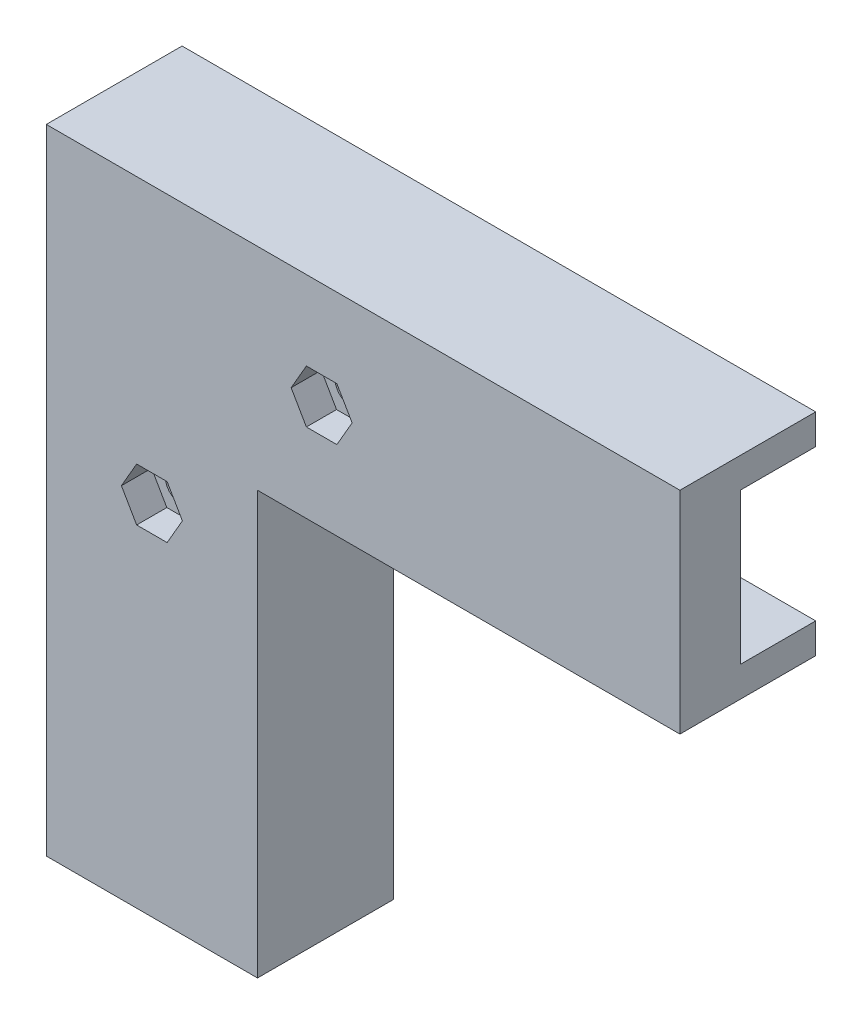
ISO-10303-21;
HEADER;
FILE_DESCRIPTION(('STEP AP214'),'2;1');
FILE_NAME('part.step','',(''),(''),'','','');
FILE_SCHEMA(('AUTOMOTIVE_DESIGN { 1 0 10303 214 1 1 1 1 }'));
ENDSEC;
DATA;
#1=APPLICATION_CONTEXT('core data for automotive mechanical design processes');
#2=APPLICATION_PROTOCOL_DEFINITION('international standard','automotive_design',2000,#1);
#3=PRODUCT_CONTEXT('',#1,'mechanical');
#4=PRODUCT('Part','Part','',(#3));
#5=PRODUCT_RELATED_PRODUCT_CATEGORY('part','',(#4));
#6=PRODUCT_DEFINITION_FORMATION('','',#4);
#7=PRODUCT_DEFINITION_CONTEXT('part definition',#1,'design');
#8=PRODUCT_DEFINITION('design','',#6,#7);
#9=PRODUCT_DEFINITION_SHAPE('','',#8);
#10=(LENGTH_UNIT() NAMED_UNIT(*) SI_UNIT(.MILLI.,.METRE.));
#11=(NAMED_UNIT(*) PLANE_ANGLE_UNIT() SI_UNIT($,.RADIAN.));
#12=(NAMED_UNIT(*) SI_UNIT($,.STERADIAN.) SOLID_ANGLE_UNIT());
#13=UNCERTAINTY_MEASURE_WITH_UNIT(LENGTH_MEASURE(1.E-05),#10,'distance_accuracy_value','');
#14=(GEOMETRIC_REPRESENTATION_CONTEXT(3) GLOBAL_UNCERTAINTY_ASSIGNED_CONTEXT((#13)) GLOBAL_UNIT_ASSIGNED_CONTEXT((#10,
#11,#12)) REPRESENTATION_CONTEXT('',''));
#15=CARTESIAN_POINT('',(0.,0.,0.));
#16=DIRECTION('',(0.,0.,1.));
#17=DIRECTION('',(1.,0.,0.));
#18=AXIS2_PLACEMENT_3D('',#15,#16,#17);
#19=CARTESIAN_POINT('',(0.,0.,8.));
#20=DIRECTION('',(0.,0.,1.));
#21=DIRECTION('',(1.,0.,0.));
#22=AXIS2_PLACEMENT_3D('',#19,#20,#21);
#23=PLANE('',#22);
#24=DIRECTION('',(1.,0.,0.));
#25=VECTOR('',#24,1.);
#26=CARTESIAN_POINT('',(-20.,0.,8.));
#27=LINE('',#26,#25);
#28=CARTESIAN_POINT('',(-24.,0.,8.));
#29=VERTEX_POINT('',#28);
#30=CARTESIAN_POINT('',(4.,0.,8.));
#31=VERTEX_POINT('',#30);
#32=EDGE_CURVE('E392',#29,#31,#27,.T.);
#33=ORIENTED_EDGE('',*,*,#32,.T.);
#34=DIRECTION('',(0.,1.,0.));
#35=VECTOR('',#34,1.);
#36=CARTESIAN_POINT('',(3.99999999999999,56.,8.));
#37=LINE('',#36,#35);
#38=CARTESIAN_POINT('',(3.99999999999999,56.,8.));
#39=VERTEX_POINT('',#38);
#40=EDGE_CURVE('E244',#31,#39,#37,.T.);
#41=ORIENTED_EDGE('',*,*,#40,.T.);
#42=DIRECTION('',(1.,0.,0.));
#43=VECTOR('',#42,1.);
#44=CARTESIAN_POINT('',(60.,56.,8.));
#45=LINE('',#44,#43);
#46=CARTESIAN_POINT('',(60.,56.,8.));
#47=VERTEX_POINT('',#46);
#48=EDGE_CURVE('E258',#39,#47,#45,.T.);
#49=ORIENTED_EDGE('',*,*,#48,.T.);
#50=DIRECTION('',(0.,1.,0.));
#51=VECTOR('',#50,1.);
#52=CARTESIAN_POINT('',(60.,60.,8.));
#53=LINE('',#52,#51);
#54=CARTESIAN_POINT('',(60.,84.,8.));
#55=VERTEX_POINT('',#54);
#56=EDGE_CURVE('E394',#47,#55,#53,.T.);
#57=ORIENTED_EDGE('',*,*,#56,.T.);
#58=DIRECTION('',(-1.,0.,0.));
#59=VECTOR('',#58,1.);
#60=CARTESIAN_POINT('',(60.,84.,8.));
#61=LINE('',#60,#59);
#62=CARTESIAN_POINT('',(-24.,84.,8.));
#63=VERTEX_POINT('',#62);
#64=EDGE_CURVE('E230',#55,#63,#61,.T.);
#65=ORIENTED_EDGE('',*,*,#64,.T.);
#66=DIRECTION('',(0.,-1.,0.));
#67=VECTOR('',#66,1.);
#68=CARTESIAN_POINT('',(-24.,84.,8.));
#69=LINE('',#68,#67);
#70=EDGE_CURVE('E227',#63,#29,#69,.T.);
#71=ORIENTED_EDGE('',*,*,#70,.T.);
#72=EDGE_LOOP('',(#33,#41,#49,#57,#65,#71));
#73=FACE_BOUND('',#72,.T.);
#74=DIRECTION('',(-1.,0.,0.));
#75=VECTOR('',#74,1.);
#76=CARTESIAN_POINT('',(0.,66.5,8.));
#77=LINE('',#76,#75);
#78=CARTESIAN_POINT('',(14.5207259421637,66.5,8.));
#79=VERTEX_POINT('',#78);
#80=CARTESIAN_POINT('',(10.4792740578363,66.5,8.));
#81=VERTEX_POINT('',#80);
#82=EDGE_CURVE('E364',#79,#81,#77,.T.);
#83=ORIENTED_EDGE('',*,*,#82,.T.);
#84=DIRECTION('',(-0.5,0.866025403784439,0.));
#85=VECTOR('',#84,1.);
#86=CARTESIAN_POINT('',(36.6548002192098,21.1626587736527,8.));
#87=LINE('',#86,#85);
#88=CARTESIAN_POINT('',(8.45854811567259,70.,8.));
#89=VERTEX_POINT('',#88);
#90=EDGE_CURVE('E336',#81,#89,#87,.T.);
#91=ORIENTED_EDGE('',*,*,#90,.T.);
#92=DIRECTION('',(0.499999999999996,0.866025403784441,0.));
#93=VECTOR('',#92,1.);
#94=CARTESIAN_POINT('',(-23.9669780457007,13.837341226347,8.));
#95=LINE('',#94,#93);
#96=CARTESIAN_POINT('',(10.4792740578363,73.5,8.));
#97=VERTEX_POINT('',#96);
#98=EDGE_CURVE('E351',#89,#97,#95,.T.);
#99=ORIENTED_EDGE('',*,*,#98,.T.);
#100=DIRECTION('',(1.,0.,0.));
#101=VECTOR('',#100,1.);
#102=CARTESIAN_POINT('',(0.,73.5,8.));
#103=LINE('',#102,#101);
#104=CARTESIAN_POINT('',(14.5207259421637,73.5,8.));
#105=VERTEX_POINT('',#104);
#106=EDGE_CURVE('E373',#97,#105,#103,.T.);
#107=ORIENTED_EDGE('',*,*,#106,.T.);
#108=DIRECTION('',(0.5,-0.866025403784439,0.));
#109=VECTOR('',#108,1.);
#110=CARTESIAN_POINT('',(42.7169780457009,24.6626587736527,8.));
#111=LINE('',#110,#109);
#112=CARTESIAN_POINT('',(16.5414518843274,70.,8.));
#113=VERTEX_POINT('',#112);
#114=EDGE_CURVE('E370',#105,#113,#111,.T.);
#115=ORIENTED_EDGE('',*,*,#114,.T.);
#116=DIRECTION('',(-0.500000000000001,-0.866025403784438,0.));
#117=VECTOR('',#116,1.);
#118=CARTESIAN_POINT('',(-17.9048002192099,10.3373412263473,8.));
#119=LINE('',#118,#117);
#120=EDGE_CURVE('E367',#113,#79,#119,.T.);
#121=ORIENTED_EDGE('',*,*,#120,.T.);
#122=EDGE_LOOP('',(#83,#91,#99,#107,#115,#121));
#123=FACE_BOUND('',#122,.T.);
#124=DIRECTION('',(-1.,0.,0.));
#125=VECTOR('',#124,1.);
#126=CARTESIAN_POINT('',(0.,44.,8.));
#127=LINE('',#126,#125);
#128=CARTESIAN_POINT('',(-7.97927405783629,44.,8.));
#129=VERTEX_POINT('',#128);
#130=CARTESIAN_POINT('',(-12.0207259421637,44.,8.));
#131=VERTEX_POINT('',#130);
#132=EDGE_CURVE('E319',#129,#131,#127,.T.);
#133=ORIENTED_EDGE('',*,*,#132,.T.);
#134=DIRECTION('',(-0.5,0.866025403784439,0.));
#135=VECTOR('',#134,1.);
#136=CARTESIAN_POINT('',(10.0370144266349,5.79487298107779,8.));
#137=LINE('',#136,#135);
#138=CARTESIAN_POINT('',(-14.0414518843274,47.5,8.));
#139=VERTEX_POINT('',#138);
#140=EDGE_CURVE('E299',#131,#139,#137,.T.);
#141=ORIENTED_EDGE('',*,*,#140,.T.);
#142=DIRECTION('',(0.5,0.866025403784438,0.));
#143=VECTOR('',#142,1.);
#144=CARTESIAN_POINT('',(-31.099192253126,17.9551270189222,8.));
#145=LINE('',#144,#143);
#146=CARTESIAN_POINT('',(-12.0207259421637,51.,8.));
#147=VERTEX_POINT('',#146);
#148=EDGE_CURVE('E306',#139,#147,#145,.T.);
#149=ORIENTED_EDGE('',*,*,#148,.T.);
#150=DIRECTION('',(1.,0.,0.));
#151=VECTOR('',#150,1.);
#152=CARTESIAN_POINT('',(-1.75126958938504E-13,51.,8.));
#153=LINE('',#152,#151);
#154=CARTESIAN_POINT('',(-7.97927405783632,51.,8.));
#155=VERTEX_POINT('',#154);
#156=EDGE_CURVE('E328',#147,#155,#153,.T.);
#157=ORIENTED_EDGE('',*,*,#156,.T.);
#158=DIRECTION('',(0.5,-0.866025403784439,0.));
#159=VECTOR('',#158,1.);
#160=CARTESIAN_POINT('',(16.0991922531259,9.29487298107778,8.));
#161=LINE('',#160,#159);
#162=CARTESIAN_POINT('',(-5.95854811567261,47.5,8.));
#163=VERTEX_POINT('',#162);
#164=EDGE_CURVE('E325',#155,#163,#161,.T.);
#165=ORIENTED_EDGE('',*,*,#164,.T.);
#166=DIRECTION('',(-0.499999999999999,-0.866025403784439,0.));
#167=VECTOR('',#166,1.);
#168=CARTESIAN_POINT('',(-25.0370144266349,14.4551270189221,8.));
#169=LINE('',#168,#167);
#170=EDGE_CURVE('E322',#163,#129,#169,.T.);
#171=ORIENTED_EDGE('',*,*,#170,.T.);
#172=EDGE_LOOP('',(#133,#141,#149,#157,#165,#171));
#173=FACE_BOUND('',#172,.T.);
#174=ADVANCED_FACE('F33',(#73,#123,#173),#23,.T.);
#175=CARTESIAN_POINT('',(-20.,0.,8.));
#176=DIRECTION('',(0.,1.,0.));
#177=DIRECTION('',(0.,0.,1.));
#178=AXIS2_PLACEMENT_3D('',#175,#176,#177);
#179=PLANE('',#178);
#180=DIRECTION('',(1.,0.,0.));
#181=VECTOR('',#180,1.);
#182=CARTESIAN_POINT('',(-20.,0.,0.));
#183=LINE('',#182,#181);
#184=CARTESIAN_POINT('',(-20.,0.,0.));
#185=VERTEX_POINT('',#184);
#186=CARTESIAN_POINT('',(0.,0.,0.));
#187=VERTEX_POINT('',#186);
#188=EDGE_CURVE('E381',#185,#187,#183,.T.);
#189=ORIENTED_EDGE('',*,*,#188,.T.);
#190=DIRECTION('',(0.,0.,1.));
#191=VECTOR('',#190,1.);
#192=CARTESIAN_POINT('',(0.,0.,-10.));
#193=LINE('',#192,#191);
#194=CARTESIAN_POINT('',(0.,0.,-10.));
#195=VERTEX_POINT('',#194);
#196=EDGE_CURVE('E277',#195,#187,#193,.T.);
#197=ORIENTED_EDGE('',*,*,#196,.F.);
#198=DIRECTION('',(1.,0.,0.));
#199=VECTOR('',#198,1.);
#200=CARTESIAN_POINT('',(4.,0.,-10.));
#201=LINE('',#200,#199);
#202=CARTESIAN_POINT('',(4.,0.,-10.));
#203=VERTEX_POINT('',#202);
#204=EDGE_CURVE('E254',#195,#203,#201,.T.);
#205=ORIENTED_EDGE('',*,*,#204,.T.);
#206=DIRECTION('',(0.,0.,1.));
#207=VECTOR('',#206,1.);
#208=CARTESIAN_POINT('',(4.,0.,-10.));
#209=LINE('',#208,#207);
#210=EDGE_CURVE('E272',#203,#31,#209,.T.);
#211=ORIENTED_EDGE('',*,*,#210,.T.);
#212=ORIENTED_EDGE('',*,*,#32,.F.);
#213=DIRECTION('',(0.,0.,1.));
#214=VECTOR('',#213,1.);
#215=CARTESIAN_POINT('',(-24.,0.,-10.));
#216=LINE('',#215,#214);
#217=CARTESIAN_POINT('',(-24.,0.,-10.));
#218=VERTEX_POINT('',#217);
#219=EDGE_CURVE('E248',#218,#29,#216,.T.);
#220=ORIENTED_EDGE('',*,*,#219,.F.);
#221=DIRECTION('',(1.,0.,0.));
#222=VECTOR('',#221,1.);
#223=CARTESIAN_POINT('',(-24.,0.,-10.));
#224=LINE('',#223,#222);
#225=CARTESIAN_POINT('',(-20.,0.,-10.));
#226=VERTEX_POINT('',#225);
#227=EDGE_CURVE('E237',#218,#226,#224,.T.);
#228=ORIENTED_EDGE('',*,*,#227,.T.);
#229=DIRECTION('',(0.,0.,1.));
#230=VECTOR('',#229,1.);
#231=CARTESIAN_POINT('',(-20.,0.,-10.));
#232=LINE('',#231,#230);
#233=EDGE_CURVE('E245',#226,#185,#232,.T.);
#234=ORIENTED_EDGE('',*,*,#233,.T.);
#235=EDGE_LOOP('',(#189,#197,#205,#211,#212,#220,#228,#234));
#236=FACE_BOUND('',#235,.T.);
#237=ADVANCED_FACE('F428',(#236),#179,.F.);
#238=CARTESIAN_POINT('',(60.,60.,8.));
#239=DIRECTION('',(-1.,0.,0.));
#240=DIRECTION('',(0.,0.,1.));
#241=AXIS2_PLACEMENT_3D('',#238,#239,#240);
#242=PLANE('',#241);
#243=DIRECTION('',(0.,1.,0.));
#244=VECTOR('',#243,1.);
#245=CARTESIAN_POINT('',(60.,60.,0.));
#246=LINE('',#245,#244);
#247=CARTESIAN_POINT('',(60.,60.,0.));
#248=VERTEX_POINT('',#247);
#249=CARTESIAN_POINT('',(60.,80.,0.));
#250=VERTEX_POINT('',#249);
#251=EDGE_CURVE('E205',#248,#250,#246,.T.);
#252=ORIENTED_EDGE('',*,*,#251,.T.);
#253=DIRECTION('',(0.,0.,1.));
#254=VECTOR('',#253,1.);
#255=CARTESIAN_POINT('',(60.,80.,-10.));
#256=LINE('',#255,#254);
#257=CARTESIAN_POINT('',(60.,80.,-10.));
#258=VERTEX_POINT('',#257);
#259=EDGE_CURVE('E198',#258,#250,#256,.T.);
#260=ORIENTED_EDGE('',*,*,#259,.F.);
#261=DIRECTION('',(0.,1.,0.));
#262=VECTOR('',#261,1.);
#263=CARTESIAN_POINT('',(60.,80.,-10.));
#264=LINE('',#263,#262);
#265=CARTESIAN_POINT('',(60.,84.,-10.));
#266=VERTEX_POINT('',#265);
#267=EDGE_CURVE('E202',#258,#266,#264,.T.);
#268=ORIENTED_EDGE('',*,*,#267,.T.);
#269=DIRECTION('',(0.,0.,1.));
#270=VECTOR('',#269,1.);
#271=CARTESIAN_POINT('',(60.,84.,-10.));
#272=LINE('',#271,#270);
#273=EDGE_CURVE('E210',#266,#55,#272,.T.);
#274=ORIENTED_EDGE('',*,*,#273,.T.);
#275=ORIENTED_EDGE('',*,*,#56,.F.);
#276=DIRECTION('',(0.,0.,1.));
#277=VECTOR('',#276,1.);
#278=CARTESIAN_POINT('',(60.,56.,-10.));
#279=LINE('',#278,#277);
#280=CARTESIAN_POINT('',(60.,56.,-10.));
#281=VERTEX_POINT('',#280);
#282=EDGE_CURVE('E283',#281,#47,#279,.T.);
#283=ORIENTED_EDGE('',*,*,#282,.F.);
#284=DIRECTION('',(0.,1.,0.));
#285=VECTOR('',#284,1.);
#286=CARTESIAN_POINT('',(60.,60.,-10.));
#287=LINE('',#286,#285);
#288=CARTESIAN_POINT('',(60.,60.,-10.));
#289=VERTEX_POINT('',#288);
#290=EDGE_CURVE('E264',#281,#289,#287,.T.);
#291=ORIENTED_EDGE('',*,*,#290,.T.);
#292=DIRECTION('',(0.,0.,1.));
#293=VECTOR('',#292,1.);
#294=CARTESIAN_POINT('',(60.,60.,-10.));
#295=LINE('',#294,#293);
#296=EDGE_CURVE('E281',#289,#248,#295,.T.);
#297=ORIENTED_EDGE('',*,*,#296,.T.);
#298=EDGE_LOOP('',(#252,#260,#268,#274,#275,#283,#291,#297));
#299=FACE_BOUND('',#298,.T.);
#300=ADVANCED_FACE('F200',(#299),#242,.F.);
#301=CARTESIAN_POINT('',(0.,0.,0.));
#302=DIRECTION('',(0.,0.,1.));
#303=DIRECTION('',(1.,0.,0.));
#304=AXIS2_PLACEMENT_3D('',#301,#302,#303);
#305=PLANE('',#304);
#306=CARTESIAN_POINT('',(12.5,70.,0.));
#307=DIRECTION('',(0.,0.,1.));
#308=DIRECTION('',(1.,0.,0.));
#309=AXIS2_PLACEMENT_3D('',#306,#307,#308);
#310=CIRCLE('',#309,2.25);
#311=CARTESIAN_POINT('',(14.75,70.,0.));
#312=VERTEX_POINT('',#311);
#313=EDGE_CURVE('E290',#312,#312,#310,.T.);
#314=ORIENTED_EDGE('',*,*,#313,.T.);
#315=EDGE_LOOP('',(#314));
#316=FACE_BOUND('',#315,.T.);
#317=CARTESIAN_POINT('',(-10.,47.5,0.));
#318=DIRECTION('',(0.,0.,1.));
#319=DIRECTION('',(1.,0.,0.));
#320=AXIS2_PLACEMENT_3D('',#317,#318,#319);
#321=CIRCLE('',#320,2.25);
#322=CARTESIAN_POINT('',(-7.75,47.5,0.));
#323=VERTEX_POINT('',#322);
#324=EDGE_CURVE('E296',#323,#323,#321,.T.);
#325=ORIENTED_EDGE('',*,*,#324,.T.);
#326=EDGE_LOOP('',(#325));
#327=FACE_BOUND('',#326,.T.);
#328=ORIENTED_EDGE('',*,*,#188,.F.);
#329=DIRECTION('',(0.,-1.,0.));
#330=VECTOR('',#329,1.);
#331=CARTESIAN_POINT('',(-20.,80.,0.));
#332=LINE('',#331,#330);
#333=CARTESIAN_POINT('',(-20.,80.,0.));
#334=VERTEX_POINT('',#333);
#335=EDGE_CURVE('E395',#334,#185,#332,.T.);
#336=ORIENTED_EDGE('',*,*,#335,.F.);
#337=DIRECTION('',(-1.,0.,0.));
#338=VECTOR('',#337,1.);
#339=CARTESIAN_POINT('',(60.,80.,0.));
#340=LINE('',#339,#338);
#341=EDGE_CURVE('E405',#250,#334,#340,.T.);
#342=ORIENTED_EDGE('',*,*,#341,.F.);
#343=ORIENTED_EDGE('',*,*,#251,.F.);
#344=DIRECTION('',(1.,0.,0.));
#345=VECTOR('',#344,1.);
#346=CARTESIAN_POINT('',(0.,60.,0.));
#347=LINE('',#346,#345);
#348=CARTESIAN_POINT('',(6.,60.,0.));
#349=VERTEX_POINT('',#348);
#350=EDGE_CURVE('E402',#349,#248,#347,.T.);
#351=ORIENTED_EDGE('',*,*,#350,.F.);
#352=CARTESIAN_POINT('',(6.,54.,0.));
#353=DIRECTION('',(0.,0.,1.));
#354=DIRECTION('',(1.,0.,0.));
#355=AXIS2_PLACEMENT_3D('',#352,#353,#354);
#356=CIRCLE('',#355,6.);
#357=CARTESIAN_POINT('',(0.,54.,0.));
#358=VERTEX_POINT('',#357);
#359=EDGE_CURVE('E11',#349,#358,#356,.T.);
#360=ORIENTED_EDGE('',*,*,#359,.T.);
#361=DIRECTION('',(0.,1.,0.));
#362=VECTOR('',#361,1.);
#363=CARTESIAN_POINT('',(0.,0.,0.));
#364=LINE('',#363,#362);
#365=EDGE_CURVE('E400',#187,#358,#364,.T.);
#366=ORIENTED_EDGE('',*,*,#365,.F.);
#367=EDGE_LOOP('',(#328,#336,#342,#343,#351,#360,#366));
#368=FACE_BOUND('',#367,.T.);
#369=ADVANCED_FACE('F440',(#316,#327,#368),#305,.F.);
#370=CARTESIAN_POINT('',(36.6548002192098,21.1626587736527,4.));
#371=DIRECTION('',(0.866025403784439,0.5,0.));
#372=DIRECTION('',(-0.5,0.866025403784439,0.));
#373=AXIS2_PLACEMENT_3D('',#370,#371,#372);
#374=PLANE('',#373);
#375=ORIENTED_EDGE('',*,*,#90,.F.);
#376=DIRECTION('',(0.,0.,1.));
#377=VECTOR('',#376,1.);
#378=CARTESIAN_POINT('',(10.4792740578363,66.5,4.));
#379=LINE('',#378,#377);
#380=CARTESIAN_POINT('',(10.4792740578363,66.5,4.));
#381=VERTEX_POINT('',#380);
#382=EDGE_CURVE('E361',#381,#81,#379,.T.);
#383=ORIENTED_EDGE('',*,*,#382,.F.);
#384=DIRECTION('',(-0.5,0.866025403784439,0.));
#385=VECTOR('',#384,1.);
#386=CARTESIAN_POINT('',(36.6548002192098,21.1626587736527,4.));
#387=LINE('',#386,#385);
#388=CARTESIAN_POINT('',(8.45854811567259,70.,4.));
#389=VERTEX_POINT('',#388);
#390=EDGE_CURVE('E347',#381,#389,#387,.T.);
#391=ORIENTED_EDGE('',*,*,#390,.T.);
#392=DIRECTION('',(0.,0.,1.));
#393=VECTOR('',#392,1.);
#394=CARTESIAN_POINT('',(8.45854811567259,70.,4.));
#395=LINE('',#394,#393);
#396=EDGE_CURVE('E378',#389,#89,#395,.T.);
#397=ORIENTED_EDGE('',*,*,#396,.T.);
#398=EDGE_LOOP('',(#375,#383,#391,#397));
#399=FACE_BOUND('',#398,.T.);
#400=ADVANCED_FACE('F438',(#399),#374,.T.);
#401=CARTESIAN_POINT('',(-23.9669780457007,13.837341226347,4.));
#402=DIRECTION('',(0.866025403784441,-0.499999999999996,0.));
#403=DIRECTION('',(0.499999999999996,0.866025403784441,0.));
#404=AXIS2_PLACEMENT_3D('',#401,#402,#403);
#405=PLANE('',#404);
#406=ORIENTED_EDGE('',*,*,#98,.F.);
#407=ORIENTED_EDGE('',*,*,#396,.F.);
#408=DIRECTION('',(0.499999999999996,0.866025403784441,0.));
#409=VECTOR('',#408,1.);
#410=CARTESIAN_POINT('',(-23.9669780457007,13.837341226347,4.));
#411=LINE('',#410,#409);
#412=CARTESIAN_POINT('',(10.4792740578363,73.5,4.));
#413=VERTEX_POINT('',#412);
#414=EDGE_CURVE('E359',#389,#413,#411,.T.);
#415=ORIENTED_EDGE('',*,*,#414,.T.);
#416=DIRECTION('',(0.,0.,1.));
#417=VECTOR('',#416,1.);
#418=CARTESIAN_POINT('',(10.4792740578363,73.5,4.));
#419=LINE('',#418,#417);
#420=EDGE_CURVE('E382',#413,#97,#419,.T.);
#421=ORIENTED_EDGE('',*,*,#420,.T.);
#422=EDGE_LOOP('',(#406,#407,#415,#421));
#423=FACE_BOUND('',#422,.T.);
#424=ADVANCED_FACE('F462',(#423),#405,.T.);
#425=CARTESIAN_POINT('',(0.,73.5,4.));
#426=DIRECTION('',(0.,-1.,0.));
#427=DIRECTION('',(0.,0.,-1.));
#428=AXIS2_PLACEMENT_3D('',#425,#426,#427);
#429=PLANE('',#428);
#430=ORIENTED_EDGE('',*,*,#106,.F.);
#431=ORIENTED_EDGE('',*,*,#420,.F.);
#432=DIRECTION('',(1.,0.,0.));
#433=VECTOR('',#432,1.);
#434=CARTESIAN_POINT('',(0.,73.5,4.));
#435=LINE('',#434,#433);
#436=CARTESIAN_POINT('',(14.5207259421637,73.5,4.));
#437=VERTEX_POINT('',#436);
#438=EDGE_CURVE('E357',#413,#437,#435,.T.);
#439=ORIENTED_EDGE('',*,*,#438,.T.);
#440=DIRECTION('',(0.,0.,1.));
#441=VECTOR('',#440,1.);
#442=CARTESIAN_POINT('',(14.5207259421637,73.5,4.));
#443=LINE('',#442,#441);
#444=EDGE_CURVE('E384',#437,#105,#443,.T.);
#445=ORIENTED_EDGE('',*,*,#444,.T.);
#446=EDGE_LOOP('',(#430,#431,#439,#445));
#447=FACE_BOUND('',#446,.T.);
#448=ADVANCED_FACE('F469',(#447),#429,.T.);
#449=CARTESIAN_POINT('',(42.7169780457009,24.6626587736527,4.));
#450=DIRECTION('',(-0.866025403784439,-0.5,0.));
#451=DIRECTION('',(0.5,-0.866025403784439,0.));
#452=AXIS2_PLACEMENT_3D('',#449,#450,#451);
#453=PLANE('',#452);
#454=ORIENTED_EDGE('',*,*,#114,.F.);
#455=ORIENTED_EDGE('',*,*,#444,.F.);
#456=DIRECTION('',(0.5,-0.866025403784439,0.));
#457=VECTOR('',#456,1.);
#458=CARTESIAN_POINT('',(42.7169780457009,24.6626587736527,4.));
#459=LINE('',#458,#457);
#460=CARTESIAN_POINT('',(16.5414518843274,70.,4.));
#461=VERTEX_POINT('',#460);
#462=EDGE_CURVE('E355',#437,#461,#459,.T.);
#463=ORIENTED_EDGE('',*,*,#462,.T.);
#464=DIRECTION('',(0.,0.,1.));
#465=VECTOR('',#464,1.);
#466=CARTESIAN_POINT('',(16.5414518843274,70.,4.));
#467=LINE('',#466,#465);
#468=EDGE_CURVE('E386',#461,#113,#467,.T.);
#469=ORIENTED_EDGE('',*,*,#468,.T.);
#470=EDGE_LOOP('',(#454,#455,#463,#469));
#471=FACE_BOUND('',#470,.T.);
#472=ADVANCED_FACE('F477',(#471),#453,.T.);
#473=CARTESIAN_POINT('',(-17.9048002192099,10.3373412263473,4.));
#474=DIRECTION('',(-0.866025403784438,0.500000000000001,0.));
#475=DIRECTION('',(-0.500000000000001,-0.866025403784438,0.));
#476=AXIS2_PLACEMENT_3D('',#473,#474,#475);
#477=PLANE('',#476);
#478=ORIENTED_EDGE('',*,*,#120,.F.);
#479=ORIENTED_EDGE('',*,*,#468,.F.);
#480=DIRECTION('',(-0.500000000000001,-0.866025403784438,0.));
#481=VECTOR('',#480,1.);
#482=CARTESIAN_POINT('',(-17.9048002192099,10.3373412263473,4.));
#483=LINE('',#482,#481);
#484=CARTESIAN_POINT('',(14.5207259421637,66.5,4.));
#485=VERTEX_POINT('',#484);
#486=EDGE_CURVE('E353',#461,#485,#483,.T.);
#487=ORIENTED_EDGE('',*,*,#486,.T.);
#488=DIRECTION('',(0.,0.,1.));
#489=VECTOR('',#488,1.);
#490=CARTESIAN_POINT('',(14.5207259421637,66.5,4.));
#491=LINE('',#490,#489);
#492=EDGE_CURVE('E388',#485,#79,#491,.T.);
#493=ORIENTED_EDGE('',*,*,#492,.T.);
#494=EDGE_LOOP('',(#478,#479,#487,#493));
#495=FACE_BOUND('',#494,.T.);
#496=ADVANCED_FACE('F485',(#495),#477,.T.);
#497=CARTESIAN_POINT('',(0.,66.5,4.));
#498=DIRECTION('',(0.,1.,0.));
#499=DIRECTION('',(0.,0.,1.));
#500=AXIS2_PLACEMENT_3D('',#497,#498,#499);
#501=PLANE('',#500);
#502=ORIENTED_EDGE('',*,*,#82,.F.);
#503=ORIENTED_EDGE('',*,*,#492,.F.);
#504=DIRECTION('',(-1.,0.,0.));
#505=VECTOR('',#504,1.);
#506=CARTESIAN_POINT('',(0.,66.5,4.));
#507=LINE('',#506,#505);
#508=EDGE_CURVE('E350',#485,#381,#507,.T.);
#509=ORIENTED_EDGE('',*,*,#508,.T.);
#510=ORIENTED_EDGE('',*,*,#382,.T.);
#511=EDGE_LOOP('',(#502,#503,#509,#510));
#512=FACE_BOUND('',#511,.T.);
#513=ADVANCED_FACE('F493',(#512),#501,.T.);
#514=CARTESIAN_POINT('',(0.,0.,4.));
#515=DIRECTION('',(0.,0.,1.));
#516=DIRECTION('',(1.,0.,0.));
#517=AXIS2_PLACEMENT_3D('',#514,#515,#516);
#518=PLANE('',#517);
#519=CARTESIAN_POINT('',(12.5,70.,4.));
#520=DIRECTION('',(0.,0.,1.));
#521=DIRECTION('',(1.,0.,0.));
#522=AXIS2_PLACEMENT_3D('',#519,#520,#521);
#523=CIRCLE('',#522,2.25);
#524=CARTESIAN_POINT('',(14.75,70.,4.));
#525=VERTEX_POINT('',#524);
#526=EDGE_CURVE('E280',#525,#525,#523,.T.);
#527=ORIENTED_EDGE('',*,*,#526,.F.);
#528=EDGE_LOOP('',(#527));
#529=FACE_BOUND('',#528,.T.);
#530=ORIENTED_EDGE('',*,*,#390,.F.);
#531=ORIENTED_EDGE('',*,*,#508,.F.);
#532=ORIENTED_EDGE('',*,*,#486,.F.);
#533=ORIENTED_EDGE('',*,*,#462,.F.);
#534=ORIENTED_EDGE('',*,*,#438,.F.);
#535=ORIENTED_EDGE('',*,*,#414,.F.);
#536=EDGE_LOOP('',(#530,#531,#532,#533,#534,#535));
#537=FACE_BOUND('',#536,.T.);
#538=ADVANCED_FACE('F501',(#529,#537),#518,.T.);
#539=CARTESIAN_POINT('',(10.0370144266349,5.79487298107779,4.));
#540=DIRECTION('',(0.866025403784439,0.5,0.));
#541=DIRECTION('',(-0.5,0.866025403784439,0.));
#542=AXIS2_PLACEMENT_3D('',#539,#540,#541);
#543=PLANE('',#542);
#544=ORIENTED_EDGE('',*,*,#140,.F.);
#545=DIRECTION('',(0.,0.,1.));
#546=VECTOR('',#545,1.);
#547=CARTESIAN_POINT('',(-12.0207259421637,44.,4.));
#548=LINE('',#547,#546);
#549=CARTESIAN_POINT('',(-12.0207259421637,44.,4.));
#550=VERTEX_POINT('',#549);
#551=EDGE_CURVE('E316',#550,#131,#548,.T.);
#552=ORIENTED_EDGE('',*,*,#551,.F.);
#553=DIRECTION('',(-0.5,0.866025403784439,0.));
#554=VECTOR('',#553,1.);
#555=CARTESIAN_POINT('',(10.0370144266349,5.79487298107779,4.));
#556=LINE('',#555,#554);
#557=CARTESIAN_POINT('',(-14.0414518843274,47.5,4.));
#558=VERTEX_POINT('',#557);
#559=EDGE_CURVE('E302',#550,#558,#556,.T.);
#560=ORIENTED_EDGE('',*,*,#559,.T.);
#561=DIRECTION('',(0.,0.,1.));
#562=VECTOR('',#561,1.);
#563=CARTESIAN_POINT('',(-14.0414518843274,47.5,4.));
#564=LINE('',#563,#562);
#565=EDGE_CURVE('E333',#558,#139,#564,.T.);
#566=ORIENTED_EDGE('',*,*,#565,.T.);
#567=EDGE_LOOP('',(#544,#552,#560,#566));
#568=FACE_BOUND('',#567,.T.);
#569=ADVANCED_FACE('F509',(#568),#543,.T.);
#570=CARTESIAN_POINT('',(-31.099192253126,17.9551270189222,4.));
#571=DIRECTION('',(0.866025403784438,-0.5,0.));
#572=DIRECTION('',(0.5,0.866025403784438,0.));
#573=AXIS2_PLACEMENT_3D('',#570,#571,#572);
#574=PLANE('',#573);
#575=ORIENTED_EDGE('',*,*,#148,.F.);
#576=ORIENTED_EDGE('',*,*,#565,.F.);
#577=DIRECTION('',(0.5,0.866025403784438,0.));
#578=VECTOR('',#577,1.);
#579=CARTESIAN_POINT('',(-31.099192253126,17.9551270189222,4.));
#580=LINE('',#579,#578);
#581=CARTESIAN_POINT('',(-12.0207259421637,51.,4.));
#582=VERTEX_POINT('',#581);
#583=EDGE_CURVE('E314',#558,#582,#580,.T.);
#584=ORIENTED_EDGE('',*,*,#583,.T.);
#585=DIRECTION('',(0.,0.,1.));
#586=VECTOR('',#585,1.);
#587=CARTESIAN_POINT('',(-12.0207259421637,51.,4.));
#588=LINE('',#587,#586);
#589=EDGE_CURVE('E337',#582,#147,#588,.T.);
#590=ORIENTED_EDGE('',*,*,#589,.T.);
#591=EDGE_LOOP('',(#575,#576,#584,#590));
#592=FACE_BOUND('',#591,.T.);
#593=ADVANCED_FACE('F518',(#592),#574,.T.);
#594=CARTESIAN_POINT('',(-1.75126958938504E-13,51.,4.));
#595=DIRECTION('',(0.,-1.,0.));
#596=DIRECTION('',(1.,0.,0.));
#597=AXIS2_PLACEMENT_3D('',#594,#595,#596);
#598=PLANE('',#597);
#599=ORIENTED_EDGE('',*,*,#156,.F.);
#600=ORIENTED_EDGE('',*,*,#589,.F.);
#601=DIRECTION('',(1.,0.,0.));
#602=VECTOR('',#601,1.);
#603=CARTESIAN_POINT('',(-1.75126958938504E-13,51.,4.));
#604=LINE('',#603,#602);
#605=CARTESIAN_POINT('',(-7.97927405783632,51.,4.));
#606=VERTEX_POINT('',#605);
#607=EDGE_CURVE('E312',#582,#606,#604,.T.);
#608=ORIENTED_EDGE('',*,*,#607,.T.);
#609=DIRECTION('',(0.,0.,1.));
#610=VECTOR('',#609,1.);
#611=CARTESIAN_POINT('',(-7.97927405783632,51.,4.));
#612=LINE('',#611,#610);
#613=EDGE_CURVE('E339',#606,#155,#612,.T.);
#614=ORIENTED_EDGE('',*,*,#613,.T.);
#615=EDGE_LOOP('',(#599,#600,#608,#614));
#616=FACE_BOUND('',#615,.T.);
#617=ADVANCED_FACE('F526',(#616),#598,.T.);
#618=CARTESIAN_POINT('',(16.0991922531259,9.29487298107778,4.));
#619=DIRECTION('',(-0.866025403784439,-0.499999999999999,0.));
#620=DIRECTION('',(0.5,-0.866025403784439,0.));
#621=AXIS2_PLACEMENT_3D('',#618,#619,#620);
#622=PLANE('',#621);
#623=ORIENTED_EDGE('',*,*,#164,.F.);
#624=ORIENTED_EDGE('',*,*,#613,.F.);
#625=DIRECTION('',(0.5,-0.866025403784439,0.));
#626=VECTOR('',#625,1.);
#627=CARTESIAN_POINT('',(16.0991922531259,9.29487298107778,4.));
#628=LINE('',#627,#626);
#629=CARTESIAN_POINT('',(-5.95854811567261,47.5,4.));
#630=VERTEX_POINT('',#629);
#631=EDGE_CURVE('E310',#606,#630,#628,.T.);
#632=ORIENTED_EDGE('',*,*,#631,.T.);
#633=DIRECTION('',(0.,0.,1.));
#634=VECTOR('',#633,1.);
#635=CARTESIAN_POINT('',(-5.95854811567261,47.5,4.));
#636=LINE('',#635,#634);
#637=EDGE_CURVE('E341',#630,#163,#636,.T.);
#638=ORIENTED_EDGE('',*,*,#637,.T.);
#639=EDGE_LOOP('',(#623,#624,#632,#638));
#640=FACE_BOUND('',#639,.T.);
#641=ADVANCED_FACE('F534',(#640),#622,.T.);
#642=CARTESIAN_POINT('',(-25.0370144266349,14.4551270189221,4.));
#643=DIRECTION('',(-0.866025403784439,0.499999999999999,0.));
#644=DIRECTION('',(-0.499999999999999,-0.866025403784439,0.));
#645=AXIS2_PLACEMENT_3D('',#642,#643,#644);
#646=PLANE('',#645);
#647=ORIENTED_EDGE('',*,*,#170,.F.);
#648=ORIENTED_EDGE('',*,*,#637,.F.);
#649=DIRECTION('',(-0.499999999999999,-0.866025403784439,0.));
#650=VECTOR('',#649,1.);
#651=CARTESIAN_POINT('',(-25.0370144266349,14.4551270189221,4.));
#652=LINE('',#651,#650);
#653=CARTESIAN_POINT('',(-7.97927405783629,44.,4.));
#654=VERTEX_POINT('',#653);
#655=EDGE_CURVE('E308',#630,#654,#652,.T.);
#656=ORIENTED_EDGE('',*,*,#655,.T.);
#657=DIRECTION('',(0.,0.,1.));
#658=VECTOR('',#657,1.);
#659=CARTESIAN_POINT('',(-7.97927405783629,44.,4.));
#660=LINE('',#659,#658);
#661=EDGE_CURVE('E343',#654,#129,#660,.T.);
#662=ORIENTED_EDGE('',*,*,#661,.T.);
#663=EDGE_LOOP('',(#647,#648,#656,#662));
#664=FACE_BOUND('',#663,.T.);
#665=ADVANCED_FACE('F542',(#664),#646,.T.);
#666=CARTESIAN_POINT('',(0.,44.,4.));
#667=DIRECTION('',(0.,1.,0.));
#668=DIRECTION('',(-1.,0.,0.));
#669=AXIS2_PLACEMENT_3D('',#666,#667,#668);
#670=PLANE('',#669);
#671=ORIENTED_EDGE('',*,*,#132,.F.);
#672=ORIENTED_EDGE('',*,*,#661,.F.);
#673=DIRECTION('',(-1.,0.,0.));
#674=VECTOR('',#673,1.);
#675=CARTESIAN_POINT('',(0.,44.,4.));
#676=LINE('',#675,#674);
#677=EDGE_CURVE('E305',#654,#550,#676,.T.);
#678=ORIENTED_EDGE('',*,*,#677,.T.);
#679=ORIENTED_EDGE('',*,*,#551,.T.);
#680=EDGE_LOOP('',(#671,#672,#678,#679));
#681=FACE_BOUND('',#680,.T.);
#682=ADVANCED_FACE('F550',(#681),#670,.T.);
#683=CARTESIAN_POINT('',(0.,0.,4.));
#684=DIRECTION('',(0.,0.,1.));
#685=DIRECTION('',(1.,0.,0.));
#686=AXIS2_PLACEMENT_3D('',#683,#684,#685);
#687=PLANE('',#686);
#688=CARTESIAN_POINT('',(-10.,47.5,4.));
#689=DIRECTION('',(0.,0.,1.));
#690=DIRECTION('',(1.,0.,0.));
#691=AXIS2_PLACEMENT_3D('',#688,#689,#690);
#692=CIRCLE('',#691,2.25);
#693=CARTESIAN_POINT('',(-7.75,47.5,4.));
#694=VERTEX_POINT('',#693);
#695=EDGE_CURVE('E293',#694,#694,#692,.T.);
#696=ORIENTED_EDGE('',*,*,#695,.F.);
#697=EDGE_LOOP('',(#696));
#698=FACE_BOUND('',#697,.T.);
#699=ORIENTED_EDGE('',*,*,#559,.F.);
#700=ORIENTED_EDGE('',*,*,#677,.F.);
#701=ORIENTED_EDGE('',*,*,#655,.F.);
#702=ORIENTED_EDGE('',*,*,#631,.F.);
#703=ORIENTED_EDGE('',*,*,#607,.F.);
#704=ORIENTED_EDGE('',*,*,#583,.F.);
#705=EDGE_LOOP('',(#699,#700,#701,#702,#703,#704));
#706=FACE_BOUND('',#705,.T.);
#707=ADVANCED_FACE('F557',(#698,#706),#687,.T.);
#708=CARTESIAN_POINT('',(-10.,47.5,0.));
#709=DIRECTION('',(0.,0.,1.));
#710=DIRECTION('',(1.,0.,0.));
#711=AXIS2_PLACEMENT_3D('',#708,#709,#710);
#712=CYLINDRICAL_SURFACE('',#711,2.25);
#713=ORIENTED_EDGE('',*,*,#324,.F.);
#714=EDGE_LOOP('',(#713));
#715=FACE_BOUND('',#714,.T.);
#716=ORIENTED_EDGE('',*,*,#695,.T.);
#717=EDGE_LOOP('',(#716));
#718=FACE_BOUND('',#717,.T.);
#719=ADVANCED_FACE('F564',(#715,#718),#712,.F.);
#720=CARTESIAN_POINT('',(12.5,70.,0.));
#721=DIRECTION('',(0.,0.,1.));
#722=DIRECTION('',(1.,0.,0.));
#723=AXIS2_PLACEMENT_3D('',#720,#721,#722);
#724=CYLINDRICAL_SURFACE('',#723,2.25);
#725=ORIENTED_EDGE('',*,*,#313,.F.);
#726=EDGE_LOOP('',(#725));
#727=FACE_BOUND('',#726,.T.);
#728=ORIENTED_EDGE('',*,*,#526,.T.);
#729=EDGE_LOOP('',(#728));
#730=FACE_BOUND('',#729,.T.);
#731=ADVANCED_FACE('F572',(#727,#730),#724,.F.);
#732=CARTESIAN_POINT('',(0.,0.,-10.));
#733=DIRECTION('',(-1.,0.,0.));
#734=DIRECTION('',(0.,0.,1.));
#735=AXIS2_PLACEMENT_3D('',#732,#733,#734);
#736=PLANE('',#735);
#737=ORIENTED_EDGE('',*,*,#365,.T.);
#738=DIRECTION('',(0.,0.,1.));
#739=VECTOR('',#738,1.);
#740=CARTESIAN_POINT('',(0.,54.,-10.));
#741=LINE('',#740,#739);
#742=CARTESIAN_POINT('',(0.,54.,-10.));
#743=VERTEX_POINT('',#742);
#744=EDGE_CURVE('E48',#358,#743,#741,.F.);
#745=ORIENTED_EDGE('',*,*,#744,.T.);
#746=DIRECTION('',(0.,-1.,0.));
#747=VECTOR('',#746,1.);
#748=CARTESIAN_POINT('',(0.,0.,-10.));
#749=LINE('',#748,#747);
#750=EDGE_CURVE('E270',#743,#195,#749,.T.);
#751=ORIENTED_EDGE('',*,*,#750,.T.);
#752=ORIENTED_EDGE('',*,*,#196,.T.);
#753=EDGE_LOOP('',(#737,#745,#751,#752));
#754=FACE_BOUND('',#753,.T.);
#755=ADVANCED_FACE('F580',(#754),#736,.T.);
#756=CARTESIAN_POINT('',(0.,60.,-10.));
#757=DIRECTION('',(0.,1.,0.));
#758=DIRECTION('',(0.,0.,1.));
#759=AXIS2_PLACEMENT_3D('',#756,#757,#758);
#760=PLANE('',#759);
#761=DIRECTION('',(-1.,0.,0.));
#762=VECTOR('',#761,1.);
#763=CARTESIAN_POINT('',(0.,60.,-10.));
#764=LINE('',#763,#762);
#765=CARTESIAN_POINT('',(6.,60.,-10.));
#766=VERTEX_POINT('',#765);
#767=EDGE_CURVE('E267',#289,#766,#764,.T.);
#768=ORIENTED_EDGE('',*,*,#767,.T.);
#769=DIRECTION('',(0.,0.,1.));
#770=VECTOR('',#769,1.);
#771=CARTESIAN_POINT('',(6.,60.,-10.));
#772=LINE('',#771,#770);
#773=EDGE_CURVE('E397',#766,#349,#772,.T.);
#774=ORIENTED_EDGE('',*,*,#773,.T.);
#775=ORIENTED_EDGE('',*,*,#350,.T.);
#776=ORIENTED_EDGE('',*,*,#296,.F.);
#777=EDGE_LOOP('',(#768,#774,#775,#776));
#778=FACE_BOUND('',#777,.T.);
#779=ADVANCED_FACE('F420',(#778),#760,.T.);
#780=CARTESIAN_POINT('',(60.,56.,-10.));
#781=DIRECTION('',(0.,-1.,0.));
#782=DIRECTION('',(1.,0.,0.));
#783=AXIS2_PLACEMENT_3D('',#780,#781,#782);
#784=PLANE('',#783);
#785=ORIENTED_EDGE('',*,*,#48,.F.);
#786=DIRECTION('',(0.,0.,1.));
#787=VECTOR('',#786,1.);
#788=CARTESIAN_POINT('',(3.99999999999999,56.,-10.));
#789=LINE('',#788,#787);
#790=CARTESIAN_POINT('',(3.99999999999999,56.,-10.));
#791=VERTEX_POINT('',#790);
#792=EDGE_CURVE('E286',#791,#39,#789,.T.);
#793=ORIENTED_EDGE('',*,*,#792,.F.);
#794=DIRECTION('',(1.,0.,0.));
#795=VECTOR('',#794,1.);
#796=CARTESIAN_POINT('',(60.,56.,-10.));
#797=LINE('',#796,#795);
#798=EDGE_CURVE('E261',#791,#281,#797,.T.);
#799=ORIENTED_EDGE('',*,*,#798,.T.);
#800=ORIENTED_EDGE('',*,*,#282,.T.);
#801=EDGE_LOOP('',(#785,#793,#799,#800));
#802=FACE_BOUND('',#801,.T.);
#803=ADVANCED_FACE('F593',(#802),#784,.T.);
#804=CARTESIAN_POINT('',(3.99999999999999,56.,-10.));
#805=DIRECTION('',(1.,0.,0.));
#806=DIRECTION('',(0.,1.,0.));
#807=AXIS2_PLACEMENT_3D('',#804,#805,#806);
#808=PLANE('',#807);
#809=ORIENTED_EDGE('',*,*,#40,.F.);
#810=ORIENTED_EDGE('',*,*,#210,.F.);
#811=DIRECTION('',(0.,1.,0.));
#812=VECTOR('',#811,1.);
#813=CARTESIAN_POINT('',(3.99999999999999,56.,-10.));
#814=LINE('',#813,#812);
#815=EDGE_CURVE('E257',#203,#791,#814,.T.);
#816=ORIENTED_EDGE('',*,*,#815,.T.);
#817=ORIENTED_EDGE('',*,*,#792,.T.);
#818=EDGE_LOOP('',(#809,#810,#816,#817));
#819=FACE_BOUND('',#818,.T.);
#820=ADVANCED_FACE('F600',(#819),#808,.T.);
#821=CARTESIAN_POINT('',(0.,0.,-10.));
#822=DIRECTION('',(0.,0.,-1.));
#823=DIRECTION('',(-1.,0.,0.));
#824=AXIS2_PLACEMENT_3D('',#821,#822,#823);
#825=PLANE('',#824);
#826=ORIENTED_EDGE('',*,*,#750,.F.);
#827=CARTESIAN_POINT('',(6.,54.,-10.));
#828=DIRECTION('',(0.,0.,-1.));
#829=DIRECTION('',(-1.,0.,0.));
#830=AXIS2_PLACEMENT_3D('',#827,#828,#829);
#831=CIRCLE('',#830,6.);
#832=EDGE_CURVE('E41',#743,#766,#831,.T.);
#833=ORIENTED_EDGE('',*,*,#832,.T.);
#834=ORIENTED_EDGE('',*,*,#767,.F.);
#835=ORIENTED_EDGE('',*,*,#290,.F.);
#836=ORIENTED_EDGE('',*,*,#798,.F.);
#837=ORIENTED_EDGE('',*,*,#815,.F.);
#838=ORIENTED_EDGE('',*,*,#204,.F.);
#839=EDGE_LOOP('',(#826,#833,#834,#835,#836,#837,#838));
#840=FACE_BOUND('',#839,.T.);
#841=ADVANCED_FACE('F414',(#840),#825,.T.);
#842=CARTESIAN_POINT('',(-20.,80.,-10.));
#843=DIRECTION('',(0.,-1.,0.));
#844=DIRECTION('',(1.,0.,0.));
#845=AXIS2_PLACEMENT_3D('',#842,#843,#844);
#846=PLANE('',#845);
#847=ORIENTED_EDGE('',*,*,#341,.T.);
#848=DIRECTION('',(0.,0.,1.));
#849=VECTOR('',#848,1.);
#850=CARTESIAN_POINT('',(-20.,80.,-10.));
#851=LINE('',#850,#849);
#852=CARTESIAN_POINT('',(-20.,80.,-10.));
#853=VERTEX_POINT('',#852);
#854=EDGE_CURVE('E226',#853,#334,#851,.T.);
#855=ORIENTED_EDGE('',*,*,#854,.F.);
#856=DIRECTION('',(1.,0.,0.));
#857=VECTOR('',#856,1.);
#858=CARTESIAN_POINT('',(-20.,80.,-10.));
#859=LINE('',#858,#857);
#860=EDGE_CURVE('E218',#853,#258,#859,.T.);
#861=ORIENTED_EDGE('',*,*,#860,.T.);
#862=ORIENTED_EDGE('',*,*,#259,.T.);
#863=EDGE_LOOP('',(#847,#855,#861,#862));
#864=FACE_BOUND('',#863,.T.);
#865=ADVANCED_FACE('F224',(#864),#846,.T.);
#866=CARTESIAN_POINT('',(-20.,0.,-10.));
#867=DIRECTION('',(1.,0.,0.));
#868=DIRECTION('',(0.,0.,-1.));
#869=AXIS2_PLACEMENT_3D('',#866,#867,#868);
#870=PLANE('',#869);
#871=ORIENTED_EDGE('',*,*,#335,.T.);
#872=ORIENTED_EDGE('',*,*,#233,.F.);
#873=DIRECTION('',(0.,1.,0.));
#874=VECTOR('',#873,1.);
#875=CARTESIAN_POINT('',(-20.,0.,-10.));
#876=LINE('',#875,#874);
#877=EDGE_CURVE('E211',#226,#853,#876,.T.);
#878=ORIENTED_EDGE('',*,*,#877,.T.);
#879=ORIENTED_EDGE('',*,*,#854,.T.);
#880=EDGE_LOOP('',(#871,#872,#878,#879));
#881=FACE_BOUND('',#880,.T.);
#882=ADVANCED_FACE('F620',(#881),#870,.T.);
#883=CARTESIAN_POINT('',(-24.,84.,-10.));
#884=DIRECTION('',(-1.,0.,0.));
#885=DIRECTION('',(0.,-1.,0.));
#886=AXIS2_PLACEMENT_3D('',#883,#884,#885);
#887=PLANE('',#886);
#888=ORIENTED_EDGE('',*,*,#70,.F.);
#889=DIRECTION('',(0.,0.,1.));
#890=VECTOR('',#889,1.);
#891=CARTESIAN_POINT('',(-24.,84.,-10.));
#892=LINE('',#891,#890);
#893=CARTESIAN_POINT('',(-24.,84.,-10.));
#894=VERTEX_POINT('',#893);
#895=EDGE_CURVE('E251',#894,#63,#892,.T.);
#896=ORIENTED_EDGE('',*,*,#895,.F.);
#897=DIRECTION('',(0.,-1.,0.));
#898=VECTOR('',#897,1.);
#899=CARTESIAN_POINT('',(-24.,84.,-10.));
#900=LINE('',#899,#898);
#901=EDGE_CURVE('E234',#894,#218,#900,.T.);
#902=ORIENTED_EDGE('',*,*,#901,.T.);
#903=ORIENTED_EDGE('',*,*,#219,.T.);
#904=EDGE_LOOP('',(#888,#896,#902,#903));
#905=FACE_BOUND('',#904,.T.);
#906=ADVANCED_FACE('F627',(#905),#887,.T.);
#907=CARTESIAN_POINT('',(60.,84.,-10.));
#908=DIRECTION('',(0.,1.,0.));
#909=DIRECTION('',(-1.,0.,0.));
#910=AXIS2_PLACEMENT_3D('',#907,#908,#909);
#911=PLANE('',#910);
#912=ORIENTED_EDGE('',*,*,#64,.F.);
#913=ORIENTED_EDGE('',*,*,#273,.F.);
#914=DIRECTION('',(-1.,0.,0.));
#915=VECTOR('',#914,1.);
#916=CARTESIAN_POINT('',(60.,84.,-10.));
#917=LINE('',#916,#915);
#918=EDGE_CURVE('E222',#266,#894,#917,.T.);
#919=ORIENTED_EDGE('',*,*,#918,.T.);
#920=ORIENTED_EDGE('',*,*,#895,.T.);
#921=EDGE_LOOP('',(#912,#913,#919,#920));
#922=FACE_BOUND('',#921,.T.);
#923=ADVANCED_FACE('F425',(#922),#911,.T.);
#924=CARTESIAN_POINT('',(0.,0.,-10.));
#925=DIRECTION('',(0.,0.,1.));
#926=DIRECTION('',(1.,0.,0.));
#927=AXIS2_PLACEMENT_3D('',#924,#925,#926);
#928=PLANE('',#927);
#929=ORIENTED_EDGE('',*,*,#860,.F.);
#930=ORIENTED_EDGE('',*,*,#877,.F.);
#931=ORIENTED_EDGE('',*,*,#227,.F.);
#932=ORIENTED_EDGE('',*,*,#901,.F.);
#933=ORIENTED_EDGE('',*,*,#918,.F.);
#934=ORIENTED_EDGE('',*,*,#267,.F.);
#935=EDGE_LOOP('',(#929,#930,#931,#932,#933,#934));
#936=FACE_BOUND('',#935,.T.);
#937=ADVANCED_FACE('F216',(#936),#928,.F.);
#938=CARTESIAN_POINT('',(6.,54.,-10.));
#939=DIRECTION('',(0.,0.,1.));
#940=DIRECTION('',(1.,0.,0.));
#941=AXIS2_PLACEMENT_3D('',#938,#939,#940);
#942=CYLINDRICAL_SURFACE('',#941,6.);
#943=ORIENTED_EDGE('',*,*,#832,.F.);
#944=ORIENTED_EDGE('',*,*,#744,.F.);
#945=ORIENTED_EDGE('',*,*,#359,.F.);
#946=ORIENTED_EDGE('',*,*,#773,.F.);
#947=EDGE_LOOP('',(#943,#944,#945,#946));
#948=FACE_BOUND('',#947,.T.);
#949=ADVANCED_FACE('F35',(#948),#942,.T.);
#950=CLOSED_SHELL('',(#174,#237,#300,#369,#400,#424,#448,#472,#496,#513,#538,#569,#593,#617,
#641,#665,#682,#707,#719,#731,#755,#779,#803,#820,#841,#865,#882,#906,#923,#937,#949));
#951=MANIFOLD_SOLID_BREP('B2',#950);
#952=ADVANCED_BREP_SHAPE_REPRESENTATION('',(#18,#951),#14);
#953=SHAPE_DEFINITION_REPRESENTATION(#9,#952);
ENDSEC;
END-ISO-10303-21;
